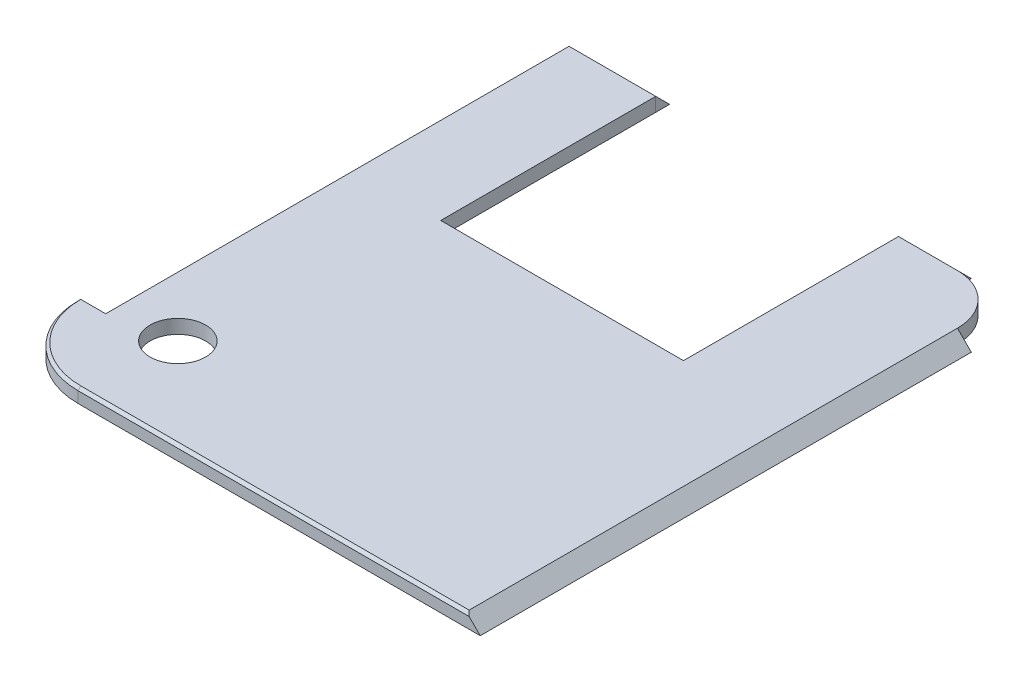
ISO-10303-21;
HEADER;
FILE_DESCRIPTION(('STEP AP214'),'2;1');
FILE_NAME('part.step','',(''),(''),'','','');
FILE_SCHEMA(('AUTOMOTIVE_DESIGN { 1 0 10303 214 1 1 1 1 }'));
ENDSEC;
DATA;
#1=APPLICATION_CONTEXT('core data for automotive mechanical design processes');
#2=APPLICATION_PROTOCOL_DEFINITION('international standard','automotive_design',2000,#1);
#3=PRODUCT_CONTEXT('',#1,'mechanical');
#4=PRODUCT('Part','Part','',(#3));
#5=PRODUCT_RELATED_PRODUCT_CATEGORY('part','',(#4));
#6=PRODUCT_DEFINITION_FORMATION('','',#4);
#7=PRODUCT_DEFINITION_CONTEXT('part definition',#1,'design');
#8=PRODUCT_DEFINITION('design','',#6,#7);
#9=PRODUCT_DEFINITION_SHAPE('','',#8);
#10=(LENGTH_UNIT() NAMED_UNIT(*) SI_UNIT(.MILLI.,.METRE.));
#11=(NAMED_UNIT(*) PLANE_ANGLE_UNIT() SI_UNIT($,.RADIAN.));
#12=(NAMED_UNIT(*) SI_UNIT($,.STERADIAN.) SOLID_ANGLE_UNIT());
#13=UNCERTAINTY_MEASURE_WITH_UNIT(LENGTH_MEASURE(1.E-05),#10,'distance_accuracy_value','');
#14=(GEOMETRIC_REPRESENTATION_CONTEXT(3) GLOBAL_UNCERTAINTY_ASSIGNED_CONTEXT((#13)) GLOBAL_UNIT_ASSIGNED_CONTEXT((#10,
#11,#12)) REPRESENTATION_CONTEXT('',''));
#15=CARTESIAN_POINT('',(0.,0.,0.));
#16=DIRECTION('',(0.,0.,1.));
#17=DIRECTION('',(1.,0.,0.));
#18=AXIS2_PLACEMENT_3D('',#15,#16,#17);
#19=CARTESIAN_POINT('',(9.57006237971607,0.,-19.6882605972922));
#20=DIRECTION('',(0.,-0.707106781186548,0.707106781186547));
#21=DIRECTION('',(0.,-0.707106781186547,-0.707106781186548));
#22=AXIS2_PLACEMENT_3D('',#19,#20,#21);
#23=PLANE('',#22);
#24=DIRECTION('',(0.,-0.707106781186547,-0.707106781186548));
#25=VECTOR('',#24,1.);
#26=CARTESIAN_POINT('',(13.8200623797161,0.,-19.6882605972922));
#27=LINE('',#26,#25);
#28=CARTESIAN_POINT('',(13.8200623797161,1.,-18.6882605972922));
#29=VERTEX_POINT('',#28);
#30=CARTESIAN_POINT('',(13.8200623797161,0.,-19.6882605972922));
#31=VERTEX_POINT('',#30);
#32=EDGE_CURVE('E105',#29,#31,#27,.T.);
#33=ORIENTED_EDGE('',*,*,#32,.T.);
#34=DIRECTION('',(1.,0.,0.));
#35=VECTOR('',#34,1.);
#36=CARTESIAN_POINT('',(9.57006237971607,0.,-19.6882605972922));
#37=LINE('',#36,#35);
#38=CARTESIAN_POINT('',(9.57006237971607,0.,-19.6882605972922));
#39=VERTEX_POINT('',#38);
#40=EDGE_CURVE('E12',#39,#31,#37,.T.);
#41=ORIENTED_EDGE('',*,*,#40,.F.);
#42=DIRECTION('',(0.,-0.707106781186547,-0.707106781186548));
#43=VECTOR('',#42,1.);
#44=CARTESIAN_POINT('',(9.57006237971607,0.,-19.6882605972922));
#45=LINE('',#44,#43);
#46=CARTESIAN_POINT('',(9.57006237971607,1.,-18.6882605972922));
#47=VERTEX_POINT('',#46);
#48=EDGE_CURVE('E98',#47,#39,#45,.T.);
#49=ORIENTED_EDGE('',*,*,#48,.F.);
#50=DIRECTION('',(1.,0.,0.));
#51=VECTOR('',#50,1.);
#52=CARTESIAN_POINT('',(9.57006237971607,1.,-18.6882605972922));
#53=LINE('',#52,#51);
#54=EDGE_CURVE('E106',#47,#29,#53,.T.);
#55=ORIENTED_EDGE('',*,*,#54,.T.);
#56=EDGE_LOOP('',(#33,#41,#49,#55));
#57=FACE_BOUND('',#56,.T.);
#58=ADVANCED_FACE('F58',(#57),#23,.F.);
#59=CARTESIAN_POINT('',(9.57006237971607,0.,-18.6882605972922));
#60=DIRECTION('',(0.,1.,0.));
#61=DIRECTION('',(0.,0.,1.));
#62=AXIS2_PLACEMENT_3D('',#59,#60,#61);
#63=PLANE('',#62);
#64=DIRECTION('',(0.,0.,1.));
#65=VECTOR('',#64,1.);
#66=CARTESIAN_POINT('',(13.8200623797161,0.,-18.6882605972922));
#67=LINE('',#66,#65);
#68=CARTESIAN_POINT('',(13.8200623797161,0.,-18.6882605972922));
#69=VERTEX_POINT('',#68);
#70=EDGE_CURVE('E86',#31,#69,#67,.T.);
#71=ORIENTED_EDGE('',*,*,#70,.T.);
#72=DIRECTION('',(1.,0.,0.));
#73=VECTOR('',#72,1.);
#74=CARTESIAN_POINT('',(9.57006237971607,0.,-18.6882605972922));
#75=LINE('',#74,#73);
#76=CARTESIAN_POINT('',(9.57006237971607,0.,-18.6882605972922));
#77=VERTEX_POINT('',#76);
#78=EDGE_CURVE('E66',#77,#69,#75,.T.);
#79=ORIENTED_EDGE('',*,*,#78,.F.);
#80=DIRECTION('',(0.,0.,1.));
#81=VECTOR('',#80,1.);
#82=CARTESIAN_POINT('',(9.57006237971607,0.,-18.6882605972922));
#83=LINE('',#82,#81);
#84=EDGE_CURVE('E94',#39,#77,#83,.T.);
#85=ORIENTED_EDGE('',*,*,#84,.F.);
#86=ORIENTED_EDGE('',*,*,#40,.T.);
#87=EDGE_LOOP('',(#71,#79,#85,#86));
#88=FACE_BOUND('',#87,.T.);
#89=ADVANCED_FACE('F95',(#88),#63,.F.);
#90=CARTESIAN_POINT('',(9.57006237971607,1.,-18.6882605972922));
#91=DIRECTION('',(0.,0.,-1.));
#92=DIRECTION('',(-1.,0.,0.));
#93=AXIS2_PLACEMENT_3D('',#90,#91,#92);
#94=PLANE('',#93);
#95=DIRECTION('',(0.,1.,0.));
#96=VECTOR('',#95,1.);
#97=CARTESIAN_POINT('',(13.8200623797161,1.,-18.6882605972922));
#98=LINE('',#97,#96);
#99=EDGE_CURVE('E91',#69,#29,#98,.T.);
#100=ORIENTED_EDGE('',*,*,#99,.T.);
#101=ORIENTED_EDGE('',*,*,#54,.F.);
#102=DIRECTION('',(0.,1.,0.));
#103=VECTOR('',#102,1.);
#104=CARTESIAN_POINT('',(9.57006237971607,1.,-18.6882605972922));
#105=LINE('',#104,#103);
#106=EDGE_CURVE('E74',#77,#47,#105,.T.);
#107=ORIENTED_EDGE('',*,*,#106,.F.);
#108=ORIENTED_EDGE('',*,*,#78,.T.);
#109=EDGE_LOOP('',(#100,#101,#107,#108));
#110=FACE_BOUND('',#109,.T.);
#111=ADVANCED_FACE('F113',(#110),#94,.F.);
#112=CARTESIAN_POINT('',(9.57006237971607,0.,0.));
#113=DIRECTION('',(1.,0.,0.));
#114=DIRECTION('',(0.,0.,-1.));
#115=AXIS2_PLACEMENT_3D('',#112,#113,#114);
#116=PLANE('',#115);
#117=ORIENTED_EDGE('',*,*,#48,.T.);
#118=ORIENTED_EDGE('',*,*,#84,.T.);
#119=ORIENTED_EDGE('',*,*,#106,.T.);
#120=EDGE_LOOP('',(#117,#118,#119));
#121=FACE_BOUND('',#120,.T.);
#122=ADVANCED_FACE('F101',(#121),#116,.F.);
#123=CARTESIAN_POINT('',(13.8200623797161,0.,0.));
#124=DIRECTION('',(1.,0.,0.));
#125=DIRECTION('',(0.,0.,-1.));
#126=AXIS2_PLACEMENT_3D('',#123,#124,#125);
#127=PLANE('',#126);
#128=ORIENTED_EDGE('',*,*,#32,.F.);
#129=ORIENTED_EDGE('',*,*,#99,.F.);
#130=ORIENTED_EDGE('',*,*,#70,.F.);
#131=EDGE_LOOP('',(#128,#129,#130));
#132=FACE_BOUND('',#131,.T.);
#133=ADVANCED_FACE('F114',(#132),#127,.T.);
#134=CLOSED_SHELL('',(#58,#89,#111,#122,#133));
#135=MANIFOLD_SOLID_BREP('B2',#134);
#136=CARTESIAN_POINT('',(-7.92993762028393,0.,-19.6882605972922));
#137=DIRECTION('',(0.,0.707106781186548,-0.707106781186547));
#138=DIRECTION('',(0.,0.707106781186547,0.707106781186548));
#139=AXIS2_PLACEMENT_3D('',#136,#137,#138);
#140=PLANE('',#139);
#141=DIRECTION('',(0.,-0.707106781186547,-0.707106781186548));
#142=VECTOR('',#141,1.);
#143=CARTESIAN_POINT('',(-14.1799376202839,0.,-19.6882605972922));
#144=LINE('',#143,#142);
#145=CARTESIAN_POINT('',(-14.1799376202839,1.,-18.6882605972922));
#146=VERTEX_POINT('',#145);
#147=CARTESIAN_POINT('',(-14.1799376202839,0.,-19.6882605972922));
#148=VERTEX_POINT('',#147);
#149=EDGE_CURVE('E228',#146,#148,#144,.T.);
#150=ORIENTED_EDGE('',*,*,#149,.F.);
#151=DIRECTION('',(-1.,0.,0.));
#152=VECTOR('',#151,1.);
#153=CARTESIAN_POINT('',(-7.92993762028393,1.,-18.6882605972922));
#154=LINE('',#153,#152);
#155=CARTESIAN_POINT('',(-7.92993762028393,1.,-18.6882605972922));
#156=VERTEX_POINT('',#155);
#157=EDGE_CURVE('E56',#156,#146,#154,.T.);
#158=ORIENTED_EDGE('',*,*,#157,.F.);
#159=DIRECTION('',(0.,-0.707106781186547,-0.707106781186548));
#160=VECTOR('',#159,1.);
#161=CARTESIAN_POINT('',(-7.92993762028393,0.,-19.6882605972922));
#162=LINE('',#161,#160);
#163=CARTESIAN_POINT('',(-7.92993762028393,0.,-19.6882605972922));
#164=VERTEX_POINT('',#163);
#165=EDGE_CURVE('E220',#156,#164,#162,.T.);
#166=ORIENTED_EDGE('',*,*,#165,.T.);
#167=DIRECTION('',(-1.,0.,0.));
#168=VECTOR('',#167,1.);
#169=CARTESIAN_POINT('',(-7.92993762028393,0.,-19.6882605972922));
#170=LINE('',#169,#168);
#171=EDGE_CURVE('E179',#164,#148,#170,.T.);
#172=ORIENTED_EDGE('',*,*,#171,.T.);
#173=EDGE_LOOP('',(#150,#158,#166,#172));
#174=FACE_BOUND('',#173,.T.);
#175=ADVANCED_FACE('F176',(#174),#140,.T.);
#176=CARTESIAN_POINT('',(-7.92993762028393,1.,-18.6882605972922));
#177=DIRECTION('',(0.,0.,1.));
#178=DIRECTION('',(1.,0.,0.));
#179=AXIS2_PLACEMENT_3D('',#176,#177,#178);
#180=PLANE('',#179);
#181=DIRECTION('',(0.,1.,0.));
#182=VECTOR('',#181,1.);
#183=CARTESIAN_POINT('',(-14.1799376202839,1.,-18.6882605972922));
#184=LINE('',#183,#182);
#185=CARTESIAN_POINT('',(-14.1799376202839,0.,-18.6882605972922));
#186=VERTEX_POINT('',#185);
#187=EDGE_CURVE('E222',#186,#146,#184,.T.);
#188=ORIENTED_EDGE('',*,*,#187,.F.);
#189=DIRECTION('',(-1.,0.,0.));
#190=VECTOR('',#189,1.);
#191=CARTESIAN_POINT('',(-7.92993762028393,0.,-18.6882605972922));
#192=LINE('',#191,#190);
#193=CARTESIAN_POINT('',(-7.92993762028393,0.,-18.6882605972922));
#194=VERTEX_POINT('',#193);
#195=EDGE_CURVE('E185',#194,#186,#192,.T.);
#196=ORIENTED_EDGE('',*,*,#195,.F.);
#197=DIRECTION('',(0.,1.,0.));
#198=VECTOR('',#197,1.);
#199=CARTESIAN_POINT('',(-7.92993762028393,1.,-18.6882605972922));
#200=LINE('',#199,#198);
#201=EDGE_CURVE('E217',#194,#156,#200,.T.);
#202=ORIENTED_EDGE('',*,*,#201,.T.);
#203=ORIENTED_EDGE('',*,*,#157,.T.);
#204=EDGE_LOOP('',(#188,#196,#202,#203));
#205=FACE_BOUND('',#204,.T.);
#206=ADVANCED_FACE('F232',(#205),#180,.T.);
#207=CARTESIAN_POINT('',(-7.92993762028393,0.,-18.6882605972922));
#208=DIRECTION('',(0.,-1.,0.));
#209=DIRECTION('',(0.,0.,-1.));
#210=AXIS2_PLACEMENT_3D('',#207,#208,#209);
#211=PLANE('',#210);
#212=DIRECTION('',(0.,0.,1.));
#213=VECTOR('',#212,1.);
#214=CARTESIAN_POINT('',(-14.1799376202839,0.,-18.6882605972922));
#215=LINE('',#214,#213);
#216=EDGE_CURVE('E215',#148,#186,#215,.T.);
#217=ORIENTED_EDGE('',*,*,#216,.F.);
#218=ORIENTED_EDGE('',*,*,#171,.F.);
#219=DIRECTION('',(0.,0.,1.));
#220=VECTOR('',#219,1.);
#221=CARTESIAN_POINT('',(-7.92993762028393,0.,-18.6882605972922));
#222=LINE('',#221,#220);
#223=EDGE_CURVE('E213',#164,#194,#222,.T.);
#224=ORIENTED_EDGE('',*,*,#223,.T.);
#225=ORIENTED_EDGE('',*,*,#195,.T.);
#226=EDGE_LOOP('',(#217,#218,#224,#225));
#227=FACE_BOUND('',#226,.T.);
#228=ADVANCED_FACE('F212',(#227),#211,.T.);
#229=CARTESIAN_POINT('',(-7.92993762028393,0.,0.));
#230=DIRECTION('',(1.,0.,0.));
#231=DIRECTION('',(0.,0.,-1.));
#232=AXIS2_PLACEMENT_3D('',#229,#230,#231);
#233=PLANE('',#232);
#234=ORIENTED_EDGE('',*,*,#165,.F.);
#235=ORIENTED_EDGE('',*,*,#201,.F.);
#236=ORIENTED_EDGE('',*,*,#223,.F.);
#237=EDGE_LOOP('',(#234,#235,#236));
#238=FACE_BOUND('',#237,.T.);
#239=ADVANCED_FACE('F219',(#238),#233,.T.);
#240=CARTESIAN_POINT('',(-14.1799376202839,0.,0.));
#241=DIRECTION('',(1.,0.,0.));
#242=DIRECTION('',(0.,0.,-1.));
#243=AXIS2_PLACEMENT_3D('',#240,#241,#242);
#244=PLANE('',#243);
#245=ORIENTED_EDGE('',*,*,#149,.T.);
#246=ORIENTED_EDGE('',*,*,#216,.T.);
#247=ORIENTED_EDGE('',*,*,#187,.T.);
#248=EDGE_LOOP('',(#245,#246,#247));
#249=FACE_BOUND('',#248,.T.);
#250=ADVANCED_FACE('F231',(#249),#244,.F.);
#251=CLOSED_SHELL('',(#175,#206,#228,#239,#250));
#252=MANIFOLD_SOLID_BREP('B6',#251);
#253=CARTESIAN_POINT('',(-15.1799376202839,0.,-18.6882605972922));
#254=DIRECTION('',(0.707106781186549,-0.707106781186545,0.));
#255=DIRECTION('',(0.707106781186545,0.70710678118655,0.));
#256=AXIS2_PLACEMENT_3D('',#253,#254,#255);
#257=PLANE('',#256);
#258=DIRECTION('',(0.707106781186545,0.70710678118655,0.));
#259=VECTOR('',#258,1.);
#260=CARTESIAN_POINT('',(-15.1799376202839,0.,14.7117394027078));
#261=LINE('',#260,#259);
#262=CARTESIAN_POINT('',(-15.1799376202839,0.,14.7117394027078));
#263=VERTEX_POINT('',#262);
#264=CARTESIAN_POINT('',(-14.1799376202839,1.,14.7117394027078));
#265=VERTEX_POINT('',#264);
#266=EDGE_CURVE('E340',#263,#265,#261,.T.);
#267=ORIENTED_EDGE('',*,*,#266,.T.);
#268=DIRECTION('',(0.,0.,1.));
#269=VECTOR('',#268,1.);
#270=CARTESIAN_POINT('',(-14.1799376202839,1.,-18.6882605972922));
#271=LINE('',#270,#269);
#272=CARTESIAN_POINT('',(-14.1799376202839,1.,-18.6882605972922));
#273=VERTEX_POINT('',#272);
#274=EDGE_CURVE('E174',#273,#265,#271,.T.);
#275=ORIENTED_EDGE('',*,*,#274,.F.);
#276=DIRECTION('',(0.707106781186545,0.70710678118655,0.));
#277=VECTOR('',#276,1.);
#278=CARTESIAN_POINT('',(-15.1799376202839,0.,-18.6882605972922));
#279=LINE('',#278,#277);
#280=CARTESIAN_POINT('',(-15.1799376202839,0.,-18.6882605972922));
#281=VERTEX_POINT('',#280);
#282=EDGE_CURVE('E333',#281,#273,#279,.T.);
#283=ORIENTED_EDGE('',*,*,#282,.F.);
#284=DIRECTION('',(0.,0.,1.));
#285=VECTOR('',#284,1.);
#286=CARTESIAN_POINT('',(-15.1799376202839,0.,-18.6882605972922));
#287=LINE('',#286,#285);
#288=EDGE_CURVE('E341',#281,#263,#287,.T.);
#289=ORIENTED_EDGE('',*,*,#288,.T.);
#290=EDGE_LOOP('',(#267,#275,#283,#289));
#291=FACE_BOUND('',#290,.T.);
#292=ADVANCED_FACE('F293',(#291),#257,.F.);
#293=CARTESIAN_POINT('',(-14.1799376202839,1.,-18.6882605972922));
#294=DIRECTION('',(-1.,0.,0.));
#295=DIRECTION('',(0.,-1.,0.));
#296=AXIS2_PLACEMENT_3D('',#293,#294,#295);
#297=PLANE('',#296);
#298=DIRECTION('',(0.,-1.,0.));
#299=VECTOR('',#298,1.);
#300=CARTESIAN_POINT('',(-14.1799376202839,1.,14.7117394027078));
#301=LINE('',#300,#299);
#302=CARTESIAN_POINT('',(-14.1799376202839,0.,14.7117394027078));
#303=VERTEX_POINT('',#302);
#304=EDGE_CURVE('E321',#265,#303,#301,.T.);
#305=ORIENTED_EDGE('',*,*,#304,.T.);
#306=DIRECTION('',(0.,0.,1.));
#307=VECTOR('',#306,1.);
#308=CARTESIAN_POINT('',(-14.1799376202839,0.,-18.6882605972922));
#309=LINE('',#308,#307);
#310=CARTESIAN_POINT('',(-14.1799376202839,0.,-18.6882605972922));
#311=VERTEX_POINT('',#310);
#312=EDGE_CURVE('E301',#311,#303,#309,.T.);
#313=ORIENTED_EDGE('',*,*,#312,.F.);
#314=DIRECTION('',(0.,-1.,0.));
#315=VECTOR('',#314,1.);
#316=CARTESIAN_POINT('',(-14.1799376202839,1.,-18.6882605972922));
#317=LINE('',#316,#315);
#318=EDGE_CURVE('E329',#273,#311,#317,.T.);
#319=ORIENTED_EDGE('',*,*,#318,.F.);
#320=ORIENTED_EDGE('',*,*,#274,.T.);
#321=EDGE_LOOP('',(#305,#313,#319,#320));
#322=FACE_BOUND('',#321,.T.);
#323=ADVANCED_FACE('F330',(#322),#297,.F.);
#324=CARTESIAN_POINT('',(-14.1799376202839,0.,-18.6882605972922));
#325=DIRECTION('',(0.,1.,0.));
#326=DIRECTION('',(0.,0.,1.));
#327=AXIS2_PLACEMENT_3D('',#324,#325,#326);
#328=PLANE('',#327);
#329=DIRECTION('',(-1.,0.,0.));
#330=VECTOR('',#329,1.);
#331=CARTESIAN_POINT('',(-14.1799376202839,0.,14.7117394027078));
#332=LINE('',#331,#330);
#333=EDGE_CURVE('E326',#303,#263,#332,.T.);
#334=ORIENTED_EDGE('',*,*,#333,.T.);
#335=ORIENTED_EDGE('',*,*,#288,.F.);
#336=DIRECTION('',(-1.,0.,0.));
#337=VECTOR('',#336,1.);
#338=CARTESIAN_POINT('',(-14.1799376202839,0.,-18.6882605972922));
#339=LINE('',#338,#337);
#340=EDGE_CURVE('E309',#311,#281,#339,.T.);
#341=ORIENTED_EDGE('',*,*,#340,.F.);
#342=ORIENTED_EDGE('',*,*,#312,.T.);
#343=EDGE_LOOP('',(#334,#335,#341,#342));
#344=FACE_BOUND('',#343,.T.);
#345=ADVANCED_FACE('F348',(#344),#328,.F.);
#346=CARTESIAN_POINT('',(0.,0.,-18.6882605972922));
#347=DIRECTION('',(0.,0.,-1.));
#348=DIRECTION('',(-1.,0.,0.));
#349=AXIS2_PLACEMENT_3D('',#346,#347,#348);
#350=PLANE('',#349);
#351=ORIENTED_EDGE('',*,*,#282,.T.);
#352=ORIENTED_EDGE('',*,*,#318,.T.);
#353=ORIENTED_EDGE('',*,*,#340,.T.);
#354=EDGE_LOOP('',(#351,#352,#353));
#355=FACE_BOUND('',#354,.T.);
#356=ADVANCED_FACE('F336',(#355),#350,.T.);
#357=CARTESIAN_POINT('',(0.,0.,14.7117394027078));
#358=DIRECTION('',(0.,0.,-1.));
#359=DIRECTION('',(-1.,0.,0.));
#360=AXIS2_PLACEMENT_3D('',#357,#358,#359);
#361=PLANE('',#360);
#362=ORIENTED_EDGE('',*,*,#266,.F.);
#363=ORIENTED_EDGE('',*,*,#333,.F.);
#364=ORIENTED_EDGE('',*,*,#304,.F.);
#365=EDGE_LOOP('',(#362,#363,#364));
#366=FACE_BOUND('',#365,.T.);
#367=ADVANCED_FACE('F349',(#366),#361,.F.);
#368=CLOSED_SHELL('',(#292,#323,#345,#356,#367));
#369=MANIFOLD_SOLID_BREP('B50',#368);
#370=CARTESIAN_POINT('',(-10.5799376202839,0.,14.7117394027078));
#371=DIRECTION('',(0.,1.,0.));
#372=DIRECTION('',(0.,0.,1.));
#373=AXIS2_PLACEMENT_3D('',#370,#371,#372);
#374=PLANE('',#373);
#375=CARTESIAN_POINT('',(-9.87993762028393,0.,13.8117394027078));
#376=DIRECTION('',(0.,1.,0.));
#377=DIRECTION('',(0.,0.,1.));
#378=AXIS2_PLACEMENT_3D('',#375,#376,#377);
#379=CIRCLE('',#378,2.);
#380=CARTESIAN_POINT('',(-9.87993762028393,0.,15.8117394027078));
#381=VERTEX_POINT('',#380);
#382=EDGE_CURVE('E800',#381,#381,#379,.F.);
#383=ORIENTED_EDGE('',*,*,#382,.F.);
#384=EDGE_LOOP('',(#383));
#385=FACE_BOUND('',#384,.T.);
#386=DIRECTION('',(-1.,0.,0.));
#387=VECTOR('',#386,1.);
#388=CARTESIAN_POINT('',(-14.1799376202839,0.,-18.6882605972922));
#389=LINE('',#388,#387);
#390=CARTESIAN_POINT('',(-7.92993762028393,0.,-18.6882605972922));
#391=VERTEX_POINT('',#390);
#392=CARTESIAN_POINT('',(-14.1799376202839,0.,-18.6882605972922));
#393=VERTEX_POINT('',#392);
#394=EDGE_CURVE('E666',#391,#393,#389,.T.);
#395=ORIENTED_EDGE('',*,*,#394,.F.);
#396=DIRECTION('',(0.,0.,1.));
#397=VECTOR('',#396,1.);
#398=CARTESIAN_POINT('',(-7.92993762028393,0.,-18.6882605972922));
#399=LINE('',#398,#397);
#400=CARTESIAN_POINT('',(-7.92993762028393,0.,-3.1882605972922));
#401=VERTEX_POINT('',#400);
#402=EDGE_CURVE('E577',#391,#401,#399,.T.);
#403=ORIENTED_EDGE('',*,*,#402,.T.);
#404=DIRECTION('',(1.,0.,0.));
#405=VECTOR('',#404,1.);
#406=CARTESIAN_POINT('',(-7.92993762028393,0.,-3.1882605972922));
#407=LINE('',#406,#405);
#408=CARTESIAN_POINT('',(9.57006237971607,0.,-3.1882605972922));
#409=VERTEX_POINT('',#408);
#410=EDGE_CURVE('E581',#401,#409,#407,.T.);
#411=ORIENTED_EDGE('',*,*,#410,.T.);
#412=DIRECTION('',(0.,0.,-1.));
#413=VECTOR('',#412,1.);
#414=CARTESIAN_POINT('',(9.57006237971607,0.,-18.6882605972922));
#415=LINE('',#414,#413);
#416=CARTESIAN_POINT('',(9.57006237971607,0.,-18.6882605972922));
#417=VERTEX_POINT('',#416);
#418=EDGE_CURVE('E586',#409,#417,#415,.T.);
#419=ORIENTED_EDGE('',*,*,#418,.T.);
#420=CARTESIAN_POINT('',(13.8200623797161,0.,-18.6882605972922));
#421=VERTEX_POINT('',#420);
#422=EDGE_CURVE('E633',#421,#417,#389,.T.);
#423=ORIENTED_EDGE('',*,*,#422,.F.);
#424=CARTESIAN_POINT('',(13.8200623797161,0.,-15.0882605972922));
#425=DIRECTION('',(0.,1.,0.));
#426=DIRECTION('',(0.,0.,1.));
#427=AXIS2_PLACEMENT_3D('',#424,#425,#426);
#428=CIRCLE('',#427,3.6);
#429=CARTESIAN_POINT('',(17.4200623797161,0.,-15.0882605972922));
#430=VERTEX_POINT('',#429);
#431=EDGE_CURVE('E663',#430,#421,#428,.T.);
#432=ORIENTED_EDGE('',*,*,#431,.F.);
#433=DIRECTION('',(1.,0.,0.));
#434=VECTOR('',#433,1.);
#435=CARTESIAN_POINT('',(17.4200623797161,0.,-15.0882605972922));
#436=LINE('',#435,#434);
#437=CARTESIAN_POINT('',(18.4200623797161,0.,-15.0882605972922));
#438=VERTEX_POINT('',#437);
#439=EDGE_CURVE('E617',#430,#438,#436,.T.);
#440=ORIENTED_EDGE('',*,*,#439,.T.);
#441=DIRECTION('',(0.,0.,1.));
#442=VECTOR('',#441,1.);
#443=CARTESIAN_POINT('',(18.4200623797161,0.,-15.0882605972922));
#444=LINE('',#443,#442);
#445=CARTESIAN_POINT('',(18.4200623797161,0.,20.3117394027078));
#446=VERTEX_POINT('',#445);
#447=EDGE_CURVE('E621',#438,#446,#444,.T.);
#448=ORIENTED_EDGE('',*,*,#447,.T.);
#449=DIRECTION('',(1.,0.,0.));
#450=VECTOR('',#449,1.);
#451=CARTESIAN_POINT('',(-10.5799376202839,0.,20.3117394027078));
#452=LINE('',#451,#450);
#453=CARTESIAN_POINT('',(-10.5799376202839,0.,20.3117394027078));
#454=VERTEX_POINT('',#453);
#455=EDGE_CURVE('E660',#454,#446,#452,.T.);
#456=ORIENTED_EDGE('',*,*,#455,.F.);
#457=CARTESIAN_POINT('',(-10.5799376202839,0.,14.7117394027078));
#458=DIRECTION('',(0.,1.,0.));
#459=DIRECTION('',(0.,0.,1.));
#460=AXIS2_PLACEMENT_3D('',#457,#458,#459);
#461=CIRCLE('',#460,5.6);
#462=CARTESIAN_POINT('',(-16.1799376202839,0.,14.7117394027078));
#463=VERTEX_POINT('',#462);
#464=EDGE_CURVE('E656',#463,#454,#461,.T.);
#465=ORIENTED_EDGE('',*,*,#464,.F.);
#466=DIRECTION('',(-1.,0.,0.));
#467=VECTOR('',#466,1.);
#468=CARTESIAN_POINT('',(-14.1799376202839,0.,14.7117394027078));
#469=LINE('',#468,#467);
#470=CARTESIAN_POINT('',(-14.1799376202839,0.,14.7117394027078));
#471=VERTEX_POINT('',#470);
#472=EDGE_CURVE('E652',#471,#463,#469,.T.);
#473=ORIENTED_EDGE('',*,*,#472,.F.);
#474=DIRECTION('',(0.,0.,1.));
#475=VECTOR('',#474,1.);
#476=CARTESIAN_POINT('',(-14.1799376202839,0.,-18.6882605972922));
#477=LINE('',#476,#475);
#478=EDGE_CURVE('E627',#393,#471,#477,.T.);
#479=ORIENTED_EDGE('',*,*,#478,.F.);
#480=EDGE_LOOP('',(#395,#403,#411,#419,#423,#432,#440,#448,#456,#465,#473,#479));
#481=FACE_BOUND('',#480,.T.);
#482=DIRECTION('',(0.,0.,1.));
#483=VECTOR('',#482,1.);
#484=CARTESIAN_POINT('',(4.42006237971607,0.,10.3117394027078));
#485=LINE('',#484,#483);
#486=CARTESIAN_POINT('',(4.42006237971607,0.,4.7117394027078));
#487=VERTEX_POINT('',#486);
#488=CARTESIAN_POINT('',(4.42006237971607,0.,10.3117394027078));
#489=VERTEX_POINT('',#488);
#490=EDGE_CURVE('E538',#487,#489,#485,.T.);
#491=ORIENTED_EDGE('',*,*,#490,.F.);
#492=DIRECTION('',(1.,0.,0.));
#493=VECTOR('',#492,1.);
#494=CARTESIAN_POINT('',(-1.17993762028393,0.,4.7117394027078));
#495=LINE('',#494,#493);
#496=CARTESIAN_POINT('',(-1.17993762028393,0.,4.7117394027078));
#497=VERTEX_POINT('',#496);
#498=EDGE_CURVE('E547',#497,#487,#495,.T.);
#499=ORIENTED_EDGE('',*,*,#498,.F.);
#500=DIRECTION('',(0.,0.,-1.));
#501=VECTOR('',#500,1.);
#502=CARTESIAN_POINT('',(-1.17993762028393,0.,10.3117394027078));
#503=LINE('',#502,#501);
#504=CARTESIAN_POINT('',(-1.17993762028393,0.,10.3117394027078));
#505=VERTEX_POINT('',#504);
#506=EDGE_CURVE('E562',#505,#497,#503,.T.);
#507=ORIENTED_EDGE('',*,*,#506,.F.);
#508=DIRECTION('',(-1.,0.,0.));
#509=VECTOR('',#508,1.);
#510=CARTESIAN_POINT('',(-1.17993762028393,0.,10.3117394027078));
#511=LINE('',#510,#509);
#512=EDGE_CURVE('E555',#489,#505,#511,.T.);
#513=ORIENTED_EDGE('',*,*,#512,.F.);
#514=EDGE_LOOP('',(#491,#499,#507,#513));
#515=FACE_BOUND('',#514,.T.);
#516=ADVANCED_FACE('F401',(#385,#481,#515),#374,.F.);
#517=CARTESIAN_POINT('',(-14.1799376202839,1.,-18.6882605972922));
#518=DIRECTION('',(0.,0.,1.));
#519=DIRECTION('',(1.,0.,0.));
#520=AXIS2_PLACEMENT_3D('',#517,#518,#519);
#521=PLANE('',#520);
#522=DIRECTION('',(-1.,0.,0.));
#523=VECTOR('',#522,1.);
#524=CARTESIAN_POINT('',(-14.1799376202839,1.,-18.6882605972922));
#525=LINE('',#524,#523);
#526=CARTESIAN_POINT('',(-7.92993762028393,1.,-18.6882605972922));
#527=VERTEX_POINT('',#526);
#528=CARTESIAN_POINT('',(-14.1799376202839,1.,-18.6882605972922));
#529=VERTEX_POINT('',#528);
#530=EDGE_CURVE('E643',#527,#529,#525,.T.);
#531=ORIENTED_EDGE('',*,*,#530,.F.);
#532=DIRECTION('',(0.,1.,0.));
#533=VECTOR('',#532,1.);
#534=CARTESIAN_POINT('',(-7.92993762028393,0.,-18.6882605972922));
#535=LINE('',#534,#533);
#536=EDGE_CURVE('E600',#391,#527,#535,.T.);
#537=ORIENTED_EDGE('',*,*,#536,.F.);
#538=ORIENTED_EDGE('',*,*,#394,.T.);
#539=DIRECTION('',(0.,-1.,0.));
#540=VECTOR('',#539,1.);
#541=CARTESIAN_POINT('',(-14.1799376202839,1.,-18.6882605972922));
#542=LINE('',#541,#540);
#543=EDGE_CURVE('E648',#529,#393,#542,.T.);
#544=ORIENTED_EDGE('',*,*,#543,.F.);
#545=EDGE_LOOP('',(#531,#537,#538,#544));
#546=FACE_BOUND('',#545,.T.);
#547=ADVANCED_FACE('F748',(#546),#521,.F.);
#548=CARTESIAN_POINT('',(-14.1799376202839,1.,-18.6882605972922));
#549=DIRECTION('',(1.,0.,0.));
#550=DIRECTION('',(0.,0.,-1.));
#551=AXIS2_PLACEMENT_3D('',#548,#549,#550);
#552=PLANE('',#551);
#553=ORIENTED_EDGE('',*,*,#478,.T.);
#554=DIRECTION('',(0.,-1.,0.));
#555=VECTOR('',#554,1.);
#556=CARTESIAN_POINT('',(-14.1799376202839,1.,14.7117394027078));
#557=LINE('',#556,#555);
#558=CARTESIAN_POINT('',(-14.1799376202839,1.,14.7117394027078));
#559=VERTEX_POINT('',#558);
#560=EDGE_CURVE('E687',#559,#471,#557,.T.);
#561=ORIENTED_EDGE('',*,*,#560,.F.);
#562=DIRECTION('',(0.,0.,1.));
#563=VECTOR('',#562,1.);
#564=CARTESIAN_POINT('',(-14.1799376202839,1.,-18.6882605972922));
#565=LINE('',#564,#563);
#566=EDGE_CURVE('E628',#529,#559,#565,.T.);
#567=ORIENTED_EDGE('',*,*,#566,.F.);
#568=ORIENTED_EDGE('',*,*,#543,.T.);
#569=EDGE_LOOP('',(#553,#561,#567,#568));
#570=FACE_BOUND('',#569,.T.);
#571=ADVANCED_FACE('F753',(#570),#552,.F.);
#572=CARTESIAN_POINT('',(-14.1799376202839,1.,14.7117394027078));
#573=DIRECTION('',(0.,0.,1.));
#574=DIRECTION('',(1.,0.,0.));
#575=AXIS2_PLACEMENT_3D('',#572,#573,#574);
#576=PLANE('',#575);
#577=DIRECTION('',(0.,-1.,0.));
#578=VECTOR('',#577,1.);
#579=CARTESIAN_POINT('',(-16.1799376202839,1.,14.7117394027078));
#580=LINE('',#579,#578);
#581=CARTESIAN_POINT('',(-16.1799376202839,0.8,14.7117394027078));
#582=VERTEX_POINT('',#581);
#583=EDGE_CURVE('E684',#582,#463,#580,.T.);
#584=ORIENTED_EDGE('',*,*,#583,.F.);
#585=DIRECTION('',(-0.707106781186552,-0.707106781186543,0.));
#586=VECTOR('',#585,1.);
#587=CARTESIAN_POINT('',(-10.5799376202839,6.39999999999993,14.7117394027078));
#588=LINE('',#587,#586);
#589=CARTESIAN_POINT('',(-15.9799376202839,1.,14.7117394027078));
#590=VERTEX_POINT('',#589);
#591=EDGE_CURVE('E291',#582,#590,#588,.F.);
#592=ORIENTED_EDGE('',*,*,#591,.T.);
#593=DIRECTION('',(-1.,0.,0.));
#594=VECTOR('',#593,1.);
#595=CARTESIAN_POINT('',(-14.1799376202839,1.,14.7117394027078));
#596=LINE('',#595,#594);
#597=EDGE_CURVE('E632',#559,#590,#596,.T.);
#598=ORIENTED_EDGE('',*,*,#597,.F.);
#599=ORIENTED_EDGE('',*,*,#560,.T.);
#600=ORIENTED_EDGE('',*,*,#472,.T.);
#601=EDGE_LOOP('',(#584,#592,#598,#599,#600));
#602=FACE_BOUND('',#601,.T.);
#603=ADVANCED_FACE('F758',(#602),#576,.F.);
#604=CARTESIAN_POINT('',(-10.5799376202839,1.,14.7117394027078));
#605=DIRECTION('',(0.,-1.,0.));
#606=DIRECTION('',(0.,0.,-1.));
#607=AXIS2_PLACEMENT_3D('',#604,#605,#606);
#608=CYLINDRICAL_SURFACE('',#607,5.6);
#609=DIRECTION('',(0.,-1.,0.));
#610=VECTOR('',#609,1.);
#611=CARTESIAN_POINT('',(-10.5799376202839,1.,20.3117394027078));
#612=LINE('',#611,#610);
#613=CARTESIAN_POINT('',(-10.5799376202839,0.8,20.3117394027078));
#614=VERTEX_POINT('',#613);
#615=EDGE_CURVE('E681',#614,#454,#612,.T.);
#616=ORIENTED_EDGE('',*,*,#615,.F.);
#617=CARTESIAN_POINT('',(-10.5799376202839,0.8,14.7117394027078));
#618=DIRECTION('',(0.,1.,0.));
#619=DIRECTION('',(0.,0.,1.));
#620=AXIS2_PLACEMENT_3D('',#617,#618,#619);
#621=CIRCLE('',#620,5.6);
#622=EDGE_CURVE('E412',#614,#582,#621,.F.);
#623=ORIENTED_EDGE('',*,*,#622,.T.);
#624=ORIENTED_EDGE('',*,*,#583,.T.);
#625=ORIENTED_EDGE('',*,*,#464,.T.);
#626=EDGE_LOOP('',(#616,#623,#624,#625));
#627=FACE_BOUND('',#626,.T.);
#628=ADVANCED_FACE('F792',(#627),#608,.T.);
#629=CARTESIAN_POINT('',(-10.5799376202839,1.,20.3117394027078));
#630=DIRECTION('',(0.,0.,-1.));
#631=DIRECTION('',(-1.,0.,0.));
#632=AXIS2_PLACEMENT_3D('',#629,#630,#631);
#633=PLANE('',#632);
#634=DIRECTION('',(-0.707106781186548,0.707106781186547,0.));
#635=VECTOR('',#634,1.);
#636=CARTESIAN_POINT('',(18.4200623797161,0.,20.3117394027078));
#637=LINE('',#636,#635);
#638=CARTESIAN_POINT('',(17.6200623797161,0.800000000000001,20.3117394027078));
#639=VERTEX_POINT('',#638);
#640=EDGE_CURVE('E603',#446,#639,#637,.T.);
#641=ORIENTED_EDGE('',*,*,#640,.T.);
#642=DIRECTION('',(-1.,0.,0.));
#643=VECTOR('',#642,1.);
#644=CARTESIAN_POINT('',(-10.5799376202839,0.8,20.3117394027078));
#645=LINE('',#644,#643);
#646=EDGE_CURVE('E426',#639,#614,#645,.T.);
#647=ORIENTED_EDGE('',*,*,#646,.T.);
#648=ORIENTED_EDGE('',*,*,#615,.T.);
#649=ORIENTED_EDGE('',*,*,#455,.T.);
#650=EDGE_LOOP('',(#641,#647,#648,#649));
#651=FACE_BOUND('',#650,.T.);
#652=ADVANCED_FACE('F791',(#651),#633,.F.);
#653=CARTESIAN_POINT('',(13.8200623797161,1.,-15.0882605972922));
#654=DIRECTION('',(0.,-1.,0.));
#655=DIRECTION('',(0.,0.,-1.));
#656=AXIS2_PLACEMENT_3D('',#653,#654,#655);
#657=CYLINDRICAL_SURFACE('',#656,3.6);
#658=ORIENTED_EDGE('',*,*,#431,.T.);
#659=DIRECTION('',(0.,-1.,0.));
#660=VECTOR('',#659,1.);
#661=CARTESIAN_POINT('',(13.8200623797161,1.,-18.6882605972922));
#662=LINE('',#661,#660);
#663=CARTESIAN_POINT('',(13.8200623797161,1.,-18.6882605972922));
#664=VERTEX_POINT('',#663);
#665=EDGE_CURVE('E673',#664,#421,#662,.T.);
#666=ORIENTED_EDGE('',*,*,#665,.F.);
#667=CARTESIAN_POINT('',(13.8200623797161,1.,-15.0882605972922));
#668=DIRECTION('',(0.,1.,0.));
#669=DIRECTION('',(0.,0.,1.));
#670=AXIS2_PLACEMENT_3D('',#667,#668,#669);
#671=CIRCLE('',#670,3.6);
#672=CARTESIAN_POINT('',(17.4200623797161,1.,-15.0882605972922));
#673=VERTEX_POINT('',#672);
#674=EDGE_CURVE('E640',#673,#664,#671,.T.);
#675=ORIENTED_EDGE('',*,*,#674,.F.);
#676=DIRECTION('',(0.,-1.,0.));
#677=VECTOR('',#676,1.);
#678=CARTESIAN_POINT('',(17.4200623797161,1.,-15.0882605972922));
#679=LINE('',#678,#677);
#680=EDGE_CURVE('E677',#673,#430,#679,.T.);
#681=ORIENTED_EDGE('',*,*,#680,.T.);
#682=EDGE_LOOP('',(#658,#666,#675,#681));
#683=FACE_BOUND('',#682,.T.);
#684=ADVANCED_FACE('F783',(#683),#657,.T.);
#685=ORIENTED_EDGE('',*,*,#422,.T.);
#686=DIRECTION('',(0.,1.,0.));
#687=VECTOR('',#686,1.);
#688=CARTESIAN_POINT('',(9.57006237971607,0.,-18.6882605972922));
#689=LINE('',#688,#687);
#690=CARTESIAN_POINT('',(9.57006237971607,1.,-18.6882605972922));
#691=VERTEX_POINT('',#690);
#692=EDGE_CURVE('E604',#417,#691,#689,.T.);
#693=ORIENTED_EDGE('',*,*,#692,.T.);
#694=EDGE_CURVE('E644',#664,#691,#525,.T.);
#695=ORIENTED_EDGE('',*,*,#694,.F.);
#696=ORIENTED_EDGE('',*,*,#665,.T.);
#697=EDGE_LOOP('',(#685,#693,#695,#696));
#698=FACE_BOUND('',#697,.T.);
#699=ADVANCED_FACE('F777',(#698),#521,.F.);
#700=CARTESIAN_POINT('',(-10.5799376202839,1.,14.7117394027078));
#701=DIRECTION('',(0.,1.,0.));
#702=DIRECTION('',(0.,0.,1.));
#703=AXIS2_PLACEMENT_3D('',#700,#701,#702);
#704=PLANE('',#703);
#705=CARTESIAN_POINT('',(-9.87993762028393,1.,13.8117394027078));
#706=DIRECTION('',(0.,1.,0.));
#707=DIRECTION('',(0.,0.,1.));
#708=AXIS2_PLACEMENT_3D('',#705,#706,#707);
#709=CIRCLE('',#708,2.);
#710=CARTESIAN_POINT('',(-9.87993762028393,1.,15.8117394027078));
#711=VERTEX_POINT('',#710);
#712=EDGE_CURVE('E803',#711,#711,#709,.T.);
#713=ORIENTED_EDGE('',*,*,#712,.F.);
#714=EDGE_LOOP('',(#713));
#715=FACE_BOUND('',#714,.T.);
#716=CARTESIAN_POINT('',(-10.5799376202839,1.,14.7117394027078));
#717=DIRECTION('',(0.,1.,0.));
#718=DIRECTION('',(0.,0.,1.));
#719=AXIS2_PLACEMENT_3D('',#716,#717,#718);
#720=CIRCLE('',#719,5.4);
#721=CARTESIAN_POINT('',(-10.5799376202839,1.,20.1117394027078));
#722=VERTEX_POINT('',#721);
#723=EDGE_CURVE('E715',#590,#722,#720,.T.);
#724=ORIENTED_EDGE('',*,*,#723,.T.);
#725=DIRECTION('',(1.,0.,0.));
#726=VECTOR('',#725,1.);
#727=CARTESIAN_POINT('',(17.4200623797161,1.,20.1117394027078));
#728=LINE('',#727,#726);
#729=CARTESIAN_POINT('',(17.4200623797161,1.,20.1117394027078));
#730=VERTEX_POINT('',#729);
#731=EDGE_CURVE('E731',#722,#730,#728,.T.);
#732=ORIENTED_EDGE('',*,*,#731,.T.);
#733=DIRECTION('',(0.,0.,-1.));
#734=VECTOR('',#733,1.);
#735=CARTESIAN_POINT('',(17.4200623797161,1.,-15.0882605972922));
#736=LINE('',#735,#734);
#737=EDGE_CURVE('E637',#730,#673,#736,.T.);
#738=ORIENTED_EDGE('',*,*,#737,.T.);
#739=ORIENTED_EDGE('',*,*,#674,.T.);
#740=ORIENTED_EDGE('',*,*,#694,.T.);
#741=DIRECTION('',(0.,0.,-1.));
#742=VECTOR('',#741,1.);
#743=CARTESIAN_POINT('',(9.57006237971607,1.,-18.6882605972922));
#744=LINE('',#743,#742);
#745=CARTESIAN_POINT('',(9.57006237971607,1.,-3.1882605972922));
#746=VERTEX_POINT('',#745);
#747=EDGE_CURVE('E582',#746,#691,#744,.T.);
#748=ORIENTED_EDGE('',*,*,#747,.F.);
#749=DIRECTION('',(1.,0.,0.));
#750=VECTOR('',#749,1.);
#751=CARTESIAN_POINT('',(-7.92993762028393,1.,-3.1882605972922));
#752=LINE('',#751,#750);
#753=CARTESIAN_POINT('',(-7.92993762028393,1.,-3.1882605972922));
#754=VERTEX_POINT('',#753);
#755=EDGE_CURVE('E594',#754,#746,#752,.T.);
#756=ORIENTED_EDGE('',*,*,#755,.F.);
#757=DIRECTION('',(0.,0.,1.));
#758=VECTOR('',#757,1.);
#759=CARTESIAN_POINT('',(-7.92993762028393,1.,-18.6882605972922));
#760=LINE('',#759,#758);
#761=EDGE_CURVE('E576',#527,#754,#760,.T.);
#762=ORIENTED_EDGE('',*,*,#761,.F.);
#763=ORIENTED_EDGE('',*,*,#530,.T.);
#764=ORIENTED_EDGE('',*,*,#566,.T.);
#765=ORIENTED_EDGE('',*,*,#597,.T.);
#766=EDGE_LOOP('',(#724,#732,#738,#739,#740,#748,#756,#762,#763,#764,#765));
#767=FACE_BOUND('',#766,.T.);
#768=ADVANCED_FACE('F762',(#715,#767),#704,.T.);
#769=CARTESIAN_POINT('',(18.4200623797161,0.,-15.0882605972922));
#770=DIRECTION('',(0.707106781186547,0.707106781186548,0.));
#771=DIRECTION('',(-0.707106781186548,0.707106781186547,0.));
#772=AXIS2_PLACEMENT_3D('',#769,#770,#771);
#773=PLANE('',#772);
#774=ORIENTED_EDGE('',*,*,#737,.F.);
#775=DIRECTION('',(0.577350269189624,-0.577350269189623,0.577350269189631));
#776=VECTOR('',#775,1.);
#777=CARTESIAN_POINT('',(6.35339571304935,12.0666666666667,9.04507273604093));
#778=LINE('',#777,#776);
#779=EDGE_CURVE('E735',#730,#639,#778,.T.);
#780=ORIENTED_EDGE('',*,*,#779,.T.);
#781=ORIENTED_EDGE('',*,*,#640,.F.);
#782=ORIENTED_EDGE('',*,*,#447,.F.);
#783=DIRECTION('',(-0.707106781186548,0.707106781186547,0.));
#784=VECTOR('',#783,1.);
#785=CARTESIAN_POINT('',(18.4200623797161,0.,-15.0882605972922));
#786=LINE('',#785,#784);
#787=EDGE_CURVE('E613',#438,#673,#786,.T.);
#788=ORIENTED_EDGE('',*,*,#787,.T.);
#789=EDGE_LOOP('',(#774,#780,#781,#782,#788));
#790=FACE_BOUND('',#789,.T.);
#791=ADVANCED_FACE('F789',(#790),#773,.T.);
#792=CARTESIAN_POINT('',(0.,0.,-15.0882605972922));
#793=DIRECTION('',(0.,0.,1.));
#794=DIRECTION('',(1.,0.,0.));
#795=AXIS2_PLACEMENT_3D('',#792,#793,#794);
#796=PLANE('',#795);
#797=ORIENTED_EDGE('',*,*,#787,.F.);
#798=ORIENTED_EDGE('',*,*,#439,.F.);
#799=ORIENTED_EDGE('',*,*,#680,.F.);
#800=EDGE_LOOP('',(#797,#798,#799));
#801=FACE_BOUND('',#800,.T.);
#802=ADVANCED_FACE('F787',(#801),#796,.F.);
#803=CARTESIAN_POINT('',(-7.92993762028393,0.,-18.6882605972922));
#804=DIRECTION('',(-1.,0.,0.));
#805=DIRECTION('',(0.,0.,1.));
#806=AXIS2_PLACEMENT_3D('',#803,#804,#805);
#807=PLANE('',#806);
#808=ORIENTED_EDGE('',*,*,#761,.T.);
#809=DIRECTION('',(0.,1.,0.));
#810=VECTOR('',#809,1.);
#811=CARTESIAN_POINT('',(-7.92993762028393,0.,-3.1882605972922));
#812=LINE('',#811,#810);
#813=EDGE_CURVE('E590',#401,#754,#812,.T.);
#814=ORIENTED_EDGE('',*,*,#813,.F.);
#815=ORIENTED_EDGE('',*,*,#402,.F.);
#816=ORIENTED_EDGE('',*,*,#536,.T.);
#817=EDGE_LOOP('',(#808,#814,#815,#816));
#818=FACE_BOUND('',#817,.T.);
#819=ADVANCED_FACE('F767',(#818),#807,.F.);
#820=CARTESIAN_POINT('',(9.57006237971607,0.,-18.6882605972922));
#821=DIRECTION('',(1.,0.,0.));
#822=DIRECTION('',(0.,0.,-1.));
#823=AXIS2_PLACEMENT_3D('',#820,#821,#822);
#824=PLANE('',#823);
#825=ORIENTED_EDGE('',*,*,#747,.T.);
#826=ORIENTED_EDGE('',*,*,#692,.F.);
#827=ORIENTED_EDGE('',*,*,#418,.F.);
#828=DIRECTION('',(0.,1.,0.));
#829=VECTOR('',#828,1.);
#830=CARTESIAN_POINT('',(9.57006237971607,0.,-3.1882605972922));
#831=LINE('',#830,#829);
#832=EDGE_CURVE('E608',#409,#746,#831,.T.);
#833=ORIENTED_EDGE('',*,*,#832,.T.);
#834=EDGE_LOOP('',(#825,#826,#827,#833));
#835=FACE_BOUND('',#834,.T.);
#836=ADVANCED_FACE('F774',(#835),#824,.F.);
#837=CARTESIAN_POINT('',(-7.92993762028393,0.,-3.1882605972922));
#838=DIRECTION('',(0.,0.,1.));
#839=DIRECTION('',(1.,0.,0.));
#840=AXIS2_PLACEMENT_3D('',#837,#838,#839);
#841=PLANE('',#840);
#842=ORIENTED_EDGE('',*,*,#755,.T.);
#843=ORIENTED_EDGE('',*,*,#832,.F.);
#844=ORIENTED_EDGE('',*,*,#410,.F.);
#845=ORIENTED_EDGE('',*,*,#813,.T.);
#846=EDGE_LOOP('',(#842,#843,#844,#845));
#847=FACE_BOUND('',#846,.T.);
#848=ADVANCED_FACE('F772',(#847),#841,.F.);
#849=CARTESIAN_POINT('',(4.42006237971607,-5.,10.3117394027078));
#850=DIRECTION('',(-1.,0.,0.));
#851=DIRECTION('',(0.,0.,1.));
#852=AXIS2_PLACEMENT_3D('',#849,#850,#851);
#853=PLANE('',#852);
#854=DIRECTION('',(0.,1.,0.));
#855=VECTOR('',#854,1.);
#856=CARTESIAN_POINT('',(4.42006237971607,-5.,10.3117394027078));
#857=LINE('',#856,#855);
#858=CARTESIAN_POINT('',(4.42006237971607,-4.00000000000001,10.3117394027078));
#859=VERTEX_POINT('',#858);
#860=EDGE_CURVE('E573',#859,#489,#857,.T.);
#861=ORIENTED_EDGE('',*,*,#860,.F.);
#862=DIRECTION('',(0.,0.,-1.));
#863=VECTOR('',#862,1.);
#864=CARTESIAN_POINT('',(4.42006237971607,-4.00000000000001,4.7117394027078));
#865=LINE('',#864,#863);
#866=CARTESIAN_POINT('',(4.42006237971607,-4.00000000000001,4.7117394027078));
#867=VERTEX_POINT('',#866);
#868=EDGE_CURVE('E540',#859,#867,#865,.T.);
#869=ORIENTED_EDGE('',*,*,#868,.T.);
#870=DIRECTION('',(0.,1.,0.));
#871=VECTOR('',#870,1.);
#872=CARTESIAN_POINT('',(4.42006237971607,-5.,4.7117394027078));
#873=LINE('',#872,#871);
#874=EDGE_CURVE('E534',#867,#487,#873,.T.);
#875=ORIENTED_EDGE('',*,*,#874,.T.);
#876=ORIENTED_EDGE('',*,*,#490,.T.);
#877=EDGE_LOOP('',(#861,#869,#875,#876));
#878=FACE_BOUND('',#877,.T.);
#879=ADVANCED_FACE('F537',(#878),#853,.F.);
#880=CARTESIAN_POINT('',(-1.17993762028393,-5.,10.3117394027078));
#881=DIRECTION('',(0.,0.,-1.));
#882=DIRECTION('',(-1.,0.,0.));
#883=AXIS2_PLACEMENT_3D('',#880,#881,#882);
#884=PLANE('',#883);
#885=DIRECTION('',(0.,1.,0.));
#886=VECTOR('',#885,1.);
#887=CARTESIAN_POINT('',(-1.17993762028393,-5.,10.3117394027078));
#888=LINE('',#887,#886);
#889=CARTESIAN_POINT('',(-1.17993762028393,-4.00000000000001,10.3117394027078));
#890=VERTEX_POINT('',#889);
#891=EDGE_CURVE('E570',#890,#505,#888,.T.);
#892=ORIENTED_EDGE('',*,*,#891,.F.);
#893=DIRECTION('',(1.,0.,0.));
#894=VECTOR('',#893,1.);
#895=CARTESIAN_POINT('',(4.42006237971607,-4.00000000000001,10.3117394027078));
#896=LINE('',#895,#894);
#897=EDGE_CURVE('E709',#890,#859,#896,.T.);
#898=ORIENTED_EDGE('',*,*,#897,.T.);
#899=ORIENTED_EDGE('',*,*,#860,.T.);
#900=ORIENTED_EDGE('',*,*,#512,.T.);
#901=EDGE_LOOP('',(#892,#898,#899,#900));
#902=FACE_BOUND('',#901,.T.);
#903=ADVANCED_FACE('F813',(#902),#884,.F.);
#904=CARTESIAN_POINT('',(-1.17993762028393,-5.,10.3117394027078));
#905=DIRECTION('',(1.,0.,0.));
#906=DIRECTION('',(0.,0.,-1.));
#907=AXIS2_PLACEMENT_3D('',#904,#905,#906);
#908=PLANE('',#907);
#909=DIRECTION('',(0.,1.,0.));
#910=VECTOR('',#909,1.);
#911=CARTESIAN_POINT('',(-1.17993762028393,-5.,4.7117394027078));
#912=LINE('',#911,#910);
#913=CARTESIAN_POINT('',(-1.17993762028393,-4.00000000000001,4.7117394027078));
#914=VERTEX_POINT('',#913);
#915=EDGE_CURVE('E546',#914,#497,#912,.T.);
#916=ORIENTED_EDGE('',*,*,#915,.F.);
#917=DIRECTION('',(0.,0.,1.));
#918=VECTOR('',#917,1.);
#919=CARTESIAN_POINT('',(-1.17993762028393,-4.00000000000001,10.3117394027078));
#920=LINE('',#919,#918);
#921=EDGE_CURVE('E712',#914,#890,#920,.T.);
#922=ORIENTED_EDGE('',*,*,#921,.T.);
#923=ORIENTED_EDGE('',*,*,#891,.T.);
#924=ORIENTED_EDGE('',*,*,#506,.T.);
#925=EDGE_LOOP('',(#916,#922,#923,#924));
#926=FACE_BOUND('',#925,.T.);
#927=ADVANCED_FACE('F830',(#926),#908,.F.);
#928=CARTESIAN_POINT('',(-1.17993762028393,-5.,4.7117394027078));
#929=DIRECTION('',(0.,0.,1.));
#930=DIRECTION('',(1.,0.,0.));
#931=AXIS2_PLACEMENT_3D('',#928,#929,#930);
#932=PLANE('',#931);
#933=ORIENTED_EDGE('',*,*,#874,.F.);
#934=DIRECTION('',(-1.,0.,0.));
#935=VECTOR('',#934,1.);
#936=CARTESIAN_POINT('',(-1.17993762028393,-4.00000000000001,4.7117394027078));
#937=LINE('',#936,#935);
#938=EDGE_CURVE('E704',#867,#914,#937,.T.);
#939=ORIENTED_EDGE('',*,*,#938,.T.);
#940=ORIENTED_EDGE('',*,*,#915,.T.);
#941=ORIENTED_EDGE('',*,*,#498,.T.);
#942=EDGE_LOOP('',(#933,#939,#940,#941));
#943=FACE_BOUND('',#942,.T.);
#944=ADVANCED_FACE('F559',(#943),#932,.F.);
#945=CARTESIAN_POINT('',(0.,-5.,0.));
#946=DIRECTION('',(0.,-1.,0.));
#947=DIRECTION('',(0.,0.,-1.));
#948=AXIS2_PLACEMENT_3D('',#945,#946,#947);
#949=PLANE('',#948);
#950=DIRECTION('',(0.,0.,-1.));
#951=VECTOR('',#950,1.);
#952=CARTESIAN_POINT('',(-0.179937620283936,-5.,4.7117394027078));
#953=LINE('',#952,#951);
#954=CARTESIAN_POINT('',(-0.179937620283936,-5.,9.3117394027078));
#955=VERTEX_POINT('',#954);
#956=CARTESIAN_POINT('',(-0.179937620283936,-5.,5.71173940270779));
#957=VERTEX_POINT('',#956);
#958=EDGE_CURVE('E691',#955,#957,#953,.T.);
#959=ORIENTED_EDGE('',*,*,#958,.T.);
#960=DIRECTION('',(1.,0.,0.));
#961=VECTOR('',#960,1.);
#962=CARTESIAN_POINT('',(4.42006237971607,-5.,5.71173940270779));
#963=LINE('',#962,#961);
#964=CARTESIAN_POINT('',(3.42006237971608,-5.,5.71173940270779));
#965=VERTEX_POINT('',#964);
#966=EDGE_CURVE('E700',#957,#965,#963,.T.);
#967=ORIENTED_EDGE('',*,*,#966,.T.);
#968=DIRECTION('',(0.,0.,1.));
#969=VECTOR('',#968,1.);
#970=CARTESIAN_POINT('',(3.42006237971608,-5.,10.3117394027078));
#971=LINE('',#970,#969);
#972=CARTESIAN_POINT('',(3.42006237971608,-5.,9.3117394027078));
#973=VERTEX_POINT('',#972);
#974=EDGE_CURVE('E697',#965,#973,#971,.T.);
#975=ORIENTED_EDGE('',*,*,#974,.T.);
#976=DIRECTION('',(-1.,0.,0.));
#977=VECTOR('',#976,1.);
#978=CARTESIAN_POINT('',(-1.17993762028393,-5.,9.3117394027078));
#979=LINE('',#978,#977);
#980=EDGE_CURVE('E694',#973,#955,#979,.T.);
#981=ORIENTED_EDGE('',*,*,#980,.T.);
#982=EDGE_LOOP('',(#959,#967,#975,#981));
#983=FACE_BOUND('',#982,.T.);
#984=ADVANCED_FACE('F835',(#983),#949,.T.);
#985=CARTESIAN_POINT('',(0.,-5.,9.3117394027078));
#986=DIRECTION('',(0.,-0.707106781186547,0.707106781186547));
#987=DIRECTION('',(1.,0.,0.));
#988=AXIS2_PLACEMENT_3D('',#985,#986,#987);
#989=PLANE('',#988);
#990=DIRECTION('',(0.577350269189626,0.577350269189626,0.577350269189626));
#991=VECTOR('',#990,1.);
#992=CARTESIAN_POINT('',(2.28004158647738,-6.14002079323869,8.17171860946911));
#993=LINE('',#992,#991);
#994=EDGE_CURVE('E722',#859,#973,#993,.F.);
#995=ORIENTED_EDGE('',*,*,#994,.F.);
#996=ORIENTED_EDGE('',*,*,#897,.F.);
#997=DIRECTION('',(-0.577350269189626,0.577350269189626,0.577350269189626));
#998=VECTOR('',#997,1.);
#999=CARTESIAN_POINT('',(2.923975513952,-8.10391313423593,6.20782626847187));
#1000=LINE('',#999,#998);
#1001=EDGE_CURVE('E557',#955,#890,#1000,.T.);
#1002=ORIENTED_EDGE('',*,*,#1001,.F.);
#1003=ORIENTED_EDGE('',*,*,#980,.F.);
#1004=EDGE_LOOP('',(#995,#996,#1002,#1003));
#1005=FACE_BOUND('',#1004,.T.);
#1006=ADVANCED_FACE('F818',(#1005),#989,.T.);
#1007=CARTESIAN_POINT('',(-0.179937620283935,-5.,0.));
#1008=DIRECTION('',(-0.707106781186547,-0.707106781186547,0.));
#1009=DIRECTION('',(0.,0.,1.));
#1010=AXIS2_PLACEMENT_3D('',#1007,#1008,#1009);
#1011=PLANE('',#1010);
#1012=ORIENTED_EDGE('',*,*,#1001,.T.);
#1013=ORIENTED_EDGE('',*,*,#921,.F.);
#1014=DIRECTION('',(0.577350269189626,-0.577350269189626,0.577350269189626));
#1015=VECTOR('',#1014,1.);
#1016=CARTESIAN_POINT('',(-2.08385075451987,-3.09608686576407,3.80782626847186));
#1017=LINE('',#1016,#1015);
#1018=EDGE_CURVE('E719',#957,#914,#1017,.F.);
#1019=ORIENTED_EDGE('',*,*,#1018,.F.);
#1020=ORIENTED_EDGE('',*,*,#958,.F.);
#1021=EDGE_LOOP('',(#1012,#1013,#1019,#1020));
#1022=FACE_BOUND('',#1021,.T.);
#1023=ADVANCED_FACE('F832',(#1022),#1011,.T.);
#1024=CARTESIAN_POINT('',(3.42006237971608,-5.,0.));
#1025=DIRECTION('',(0.707106781186547,-0.707106781186548,0.));
#1026=DIRECTION('',(0.,0.,-1.));
#1027=AXIS2_PLACEMENT_3D('',#1024,#1025,#1026);
#1028=PLANE('',#1027);
#1029=ORIENTED_EDGE('',*,*,#994,.T.);
#1030=ORIENTED_EDGE('',*,*,#974,.F.);
#1031=DIRECTION('',(0.577350269189626,0.577350269189626,-0.577350269189626));
#1032=VECTOR('',#1031,1.);
#1033=CARTESIAN_POINT('',(5.32397551395201,-3.09608686576407,3.80782626847186));
#1034=LINE('',#1033,#1032);
#1035=EDGE_CURVE('E716',#867,#965,#1034,.F.);
#1036=ORIENTED_EDGE('',*,*,#1035,.F.);
#1037=ORIENTED_EDGE('',*,*,#868,.F.);
#1038=EDGE_LOOP('',(#1029,#1030,#1036,#1037));
#1039=FACE_BOUND('',#1038,.T.);
#1040=ADVANCED_FACE('F823',(#1039),#1028,.T.);
#1041=CARTESIAN_POINT('',(0.,-5.,5.71173940270779));
#1042=DIRECTION('',(0.,-0.707106781186547,-0.707106781186547));
#1043=DIRECTION('',(-1.,0.,0.));
#1044=AXIS2_PLACEMENT_3D('',#1041,#1042,#1043);
#1045=PLANE('',#1044);
#1046=ORIENTED_EDGE('',*,*,#1018,.T.);
#1047=ORIENTED_EDGE('',*,*,#938,.F.);
#1048=ORIENTED_EDGE('',*,*,#1035,.T.);
#1049=ORIENTED_EDGE('',*,*,#966,.F.);
#1050=EDGE_LOOP('',(#1046,#1047,#1048,#1049));
#1051=FACE_BOUND('',#1050,.T.);
#1052=ADVANCED_FACE('F826',(#1051),#1045,.T.);
#1053=CARTESIAN_POINT('',(-10.5799376202839,1.,14.7117394027078));
#1054=DIRECTION('',(0.,-1.,0.));
#1055=DIRECTION('',(0.,0.,-1.));
#1056=AXIS2_PLACEMENT_3D('',#1053,#1054,#1055);
#1057=CONICAL_SURFACE('',#1056,5.4,0.785398163397455);
#1058=ORIENTED_EDGE('',*,*,#591,.F.);
#1059=ORIENTED_EDGE('',*,*,#622,.F.);
#1060=DIRECTION('',(0.,-0.707106781186543,0.707106781186552));
#1061=VECTOR('',#1060,1.);
#1062=CARTESIAN_POINT('',(-10.5799376202839,1.,20.1117394027078));
#1063=LINE('',#1062,#1061);
#1064=EDGE_CURVE('E406',#722,#614,#1063,.T.);
#1065=ORIENTED_EDGE('',*,*,#1064,.F.);
#1066=ORIENTED_EDGE('',*,*,#723,.F.);
#1067=EDGE_LOOP('',(#1058,#1059,#1065,#1066));
#1068=FACE_BOUND('',#1067,.T.);
#1069=ADVANCED_FACE('F404',(#1068),#1057,.T.);
#1070=CARTESIAN_POINT('',(-10.5799376202839,1.,20.1117394027078));
#1071=DIRECTION('',(0.,0.707106781186552,0.707106781186543));
#1072=DIRECTION('',(-1.,0.,0.));
#1073=AXIS2_PLACEMENT_3D('',#1070,#1071,#1072);
#1074=PLANE('',#1073);
#1075=ORIENTED_EDGE('',*,*,#1064,.T.);
#1076=ORIENTED_EDGE('',*,*,#646,.F.);
#1077=ORIENTED_EDGE('',*,*,#779,.F.);
#1078=ORIENTED_EDGE('',*,*,#731,.F.);
#1079=EDGE_LOOP('',(#1075,#1076,#1077,#1078));
#1080=FACE_BOUND('',#1079,.T.);
#1081=ADVANCED_FACE('F798',(#1080),#1074,.T.);
#1082=CARTESIAN_POINT('',(-9.87993762028393,-5.001,13.8117394027078));
#1083=DIRECTION('',(0.,1.,0.));
#1084=DIRECTION('',(0.,0.,1.));
#1085=AXIS2_PLACEMENT_3D('',#1082,#1083,#1084);
#1086=CYLINDRICAL_SURFACE('',#1085,2.);
#1087=ORIENTED_EDGE('',*,*,#712,.T.);
#1088=EDGE_LOOP('',(#1087));
#1089=FACE_BOUND('',#1088,.T.);
#1090=ORIENTED_EDGE('',*,*,#382,.T.);
#1091=EDGE_LOOP('',(#1090));
#1092=FACE_BOUND('',#1091,.T.);
#1093=ADVANCED_FACE('F887',(#1089,#1092),#1086,.F.);
#1094=CLOSED_SHELL('',(#516,#547,#571,#603,#628,#652,#684,#699,#768,#791,#802,#819,#836,#848,
#879,#903,#927,#944,#984,#1006,#1023,#1040,#1052,#1069,#1081,#1093));
#1095=MANIFOLD_SOLID_BREP('B168',#1094);
#1096=ADVANCED_BREP_SHAPE_REPRESENTATION('',(#18,#135,#252,#369,#1095),#14);
#1097=SHAPE_DEFINITION_REPRESENTATION(#9,#1096);
ENDSEC;
END-ISO-10303-21;
